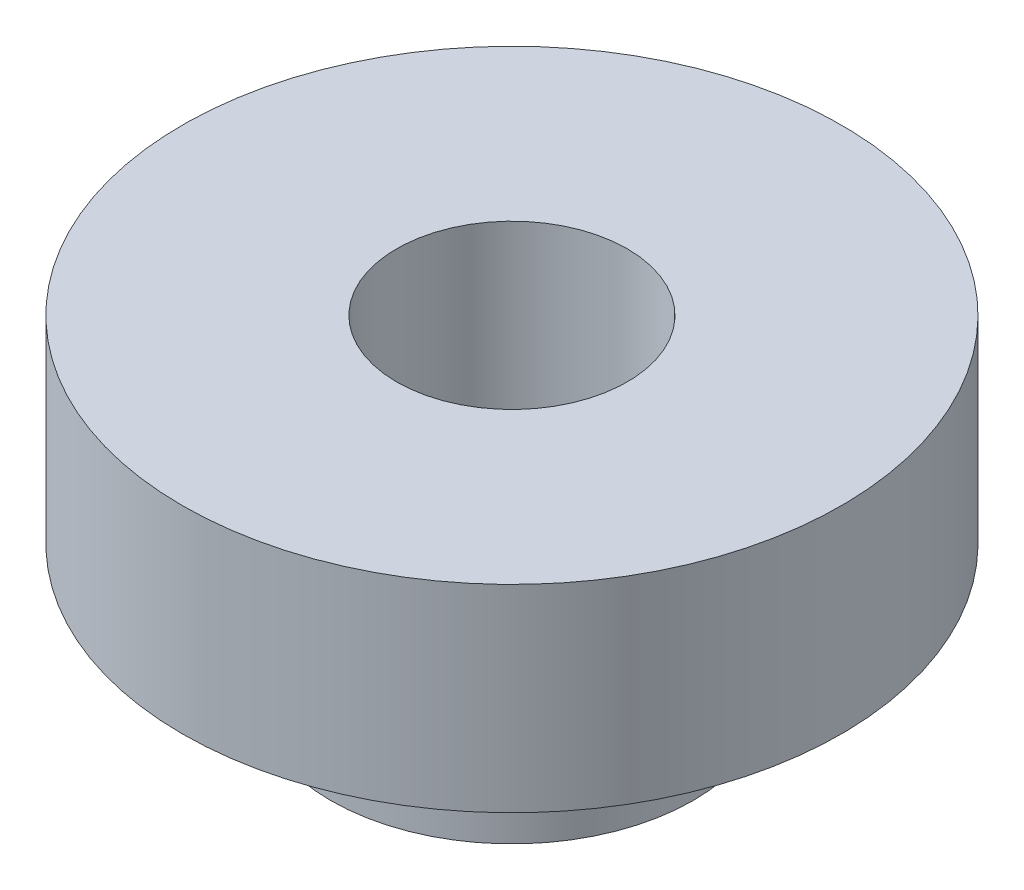
ISO-10303-21;
HEADER;
FILE_DESCRIPTION(('STEP AP214'),'2;1');
FILE_NAME('part.step','',(''),(''),'','','');
FILE_SCHEMA(('AUTOMOTIVE_DESIGN { 1 0 10303 214 1 1 1 1 }'));
ENDSEC;
DATA;
#1=APPLICATION_CONTEXT('core data for automotive mechanical design processes');
#2=APPLICATION_PROTOCOL_DEFINITION('international standard','automotive_design',2000,#1);
#3=PRODUCT_CONTEXT('',#1,'mechanical');
#4=PRODUCT('Part','Part','',(#3));
#5=PRODUCT_RELATED_PRODUCT_CATEGORY('part','',(#4));
#6=PRODUCT_DEFINITION_FORMATION('','',#4);
#7=PRODUCT_DEFINITION_CONTEXT('part definition',#1,'design');
#8=PRODUCT_DEFINITION('design','',#6,#7);
#9=PRODUCT_DEFINITION_SHAPE('','',#8);
#10=(LENGTH_UNIT() NAMED_UNIT(*) SI_UNIT(.MILLI.,.METRE.));
#11=(NAMED_UNIT(*) PLANE_ANGLE_UNIT() SI_UNIT($,.RADIAN.));
#12=(NAMED_UNIT(*) SI_UNIT($,.STERADIAN.) SOLID_ANGLE_UNIT());
#13=UNCERTAINTY_MEASURE_WITH_UNIT(LENGTH_MEASURE(1.E-05),#10,'distance_accuracy_value','');
#14=(GEOMETRIC_REPRESENTATION_CONTEXT(3) GLOBAL_UNCERTAINTY_ASSIGNED_CONTEXT((#13)) GLOBAL_UNIT_ASSIGNED_CONTEXT((#10,
#11,#12)) REPRESENTATION_CONTEXT('',''));
#15=CARTESIAN_POINT('',(0.,0.,0.));
#16=DIRECTION('',(0.,0.,1.));
#17=DIRECTION('',(1.,0.,0.));
#18=AXIS2_PLACEMENT_3D('',#15,#16,#17);
#19=CARTESIAN_POINT('',(-25.4,2.572,-2.66050878019847E-13));
#20=DIRECTION('',(0.,1.,0.));
#21=DIRECTION('',(0.,0.,1.));
#22=AXIS2_PLACEMENT_3D('',#19,#20,#21);
#23=CYLINDRICAL_SURFACE('',#22,2.75);
#24=CARTESIAN_POINT('',(-25.4,2.572,-2.66050878019847E-13));
#25=DIRECTION('',(0.,1.,0.));
#26=DIRECTION('',(0.,0.,1.));
#27=AXIS2_PLACEMENT_3D('',#24,#25,#26);
#28=CIRCLE('',#27,2.75);
#29=CARTESIAN_POINT('',(-25.4,2.572,2.74999999999973));
#30=VERTEX_POINT('',#29);
#31=EDGE_CURVE('E10',#30,#30,#28,.T.);
#32=ORIENTED_EDGE('',*,*,#31,.T.);
#33=EDGE_LOOP('',(#32));
#34=FACE_BOUND('',#33,.T.);
#35=CARTESIAN_POINT('',(-25.4,4.572,-2.66050878019847E-13));
#36=DIRECTION('',(0.,1.,0.));
#37=DIRECTION('',(0.,0.,1.));
#38=AXIS2_PLACEMENT_3D('',#35,#36,#37);
#39=CIRCLE('',#38,2.75);
#40=CARTESIAN_POINT('',(-25.4,4.572,2.74999999999973));
#41=VERTEX_POINT('',#40);
#42=EDGE_CURVE('E41',#41,#41,#39,.T.);
#43=ORIENTED_EDGE('',*,*,#42,.F.);
#44=EDGE_LOOP('',(#43));
#45=FACE_BOUND('',#44,.T.);
#46=ADVANCED_FACE('F38',(#34,#45),#23,.T.);
#47=CARTESIAN_POINT('',(-25.4,2.572,-2.66050878019847E-13));
#48=DIRECTION('',(0.,1.,0.));
#49=DIRECTION('',(0.,0.,1.));
#50=AXIS2_PLACEMENT_3D('',#47,#48,#49);
#51=PLANE('',#50);
#52=CARTESIAN_POINT('',(-25.4,2.572,-2.66050878019847E-13));
#53=DIRECTION('',(0.,1.,0.));
#54=DIRECTION('',(0.,0.,1.));
#55=AXIS2_PLACEMENT_3D('',#52,#53,#54);
#56=CIRCLE('',#55,1.75);
#57=CARTESIAN_POINT('',(-25.4,2.572,1.74999999999973));
#58=VERTEX_POINT('',#57);
#59=EDGE_CURVE('E48',#58,#58,#56,.T.);
#60=ORIENTED_EDGE('',*,*,#59,.T.);
#61=EDGE_LOOP('',(#60));
#62=FACE_BOUND('',#61,.T.);
#63=ORIENTED_EDGE('',*,*,#31,.F.);
#64=EDGE_LOOP('',(#63));
#65=FACE_BOUND('',#64,.T.);
#66=ADVANCED_FACE('F76',(#62,#65),#51,.F.);
#67=CARTESIAN_POINT('',(-25.4,2.572,-2.66050878019847E-13));
#68=DIRECTION('',(0.,1.,0.));
#69=DIRECTION('',(0.,0.,1.));
#70=AXIS2_PLACEMENT_3D('',#67,#68,#69);
#71=CYLINDRICAL_SURFACE('',#70,1.75);
#72=ORIENTED_EDGE('',*,*,#59,.F.);
#73=EDGE_LOOP('',(#72));
#74=FACE_BOUND('',#73,.T.);
#75=CARTESIAN_POINT('',(-25.4,7.572,-2.66050878019847E-13));
#76=DIRECTION('',(0.,1.,0.));
#77=DIRECTION('',(0.,0.,1.));
#78=AXIS2_PLACEMENT_3D('',#75,#76,#77);
#79=CIRCLE('',#78,1.75);
#80=CARTESIAN_POINT('',(-25.4,7.572,1.74999999999973));
#81=VERTEX_POINT('',#80);
#82=EDGE_CURVE('E56',#81,#81,#79,.T.);
#83=ORIENTED_EDGE('',*,*,#82,.T.);
#84=EDGE_LOOP('',(#83));
#85=FACE_BOUND('',#84,.T.);
#86=ADVANCED_FACE('F62',(#74,#85),#71,.F.);
#87=CARTESIAN_POINT('',(-25.4,7.572,-2.66050878019847E-13));
#88=DIRECTION('',(0.,1.,0.));
#89=DIRECTION('',(0.,0.,1.));
#90=AXIS2_PLACEMENT_3D('',#87,#88,#89);
#91=PLANE('',#90);
#92=CARTESIAN_POINT('',(-25.4,7.572,-2.66050878019847E-13));
#93=DIRECTION('',(0.,1.,0.));
#94=DIRECTION('',(0.,0.,1.));
#95=AXIS2_PLACEMENT_3D('',#92,#93,#94);
#96=CIRCLE('',#95,5.);
#97=CARTESIAN_POINT('',(-25.4,7.572,4.99999999999973));
#98=VERTEX_POINT('',#97);
#99=EDGE_CURVE('E52',#98,#98,#96,.T.);
#100=ORIENTED_EDGE('',*,*,#99,.T.);
#101=EDGE_LOOP('',(#100));
#102=FACE_BOUND('',#101,.T.);
#103=ORIENTED_EDGE('',*,*,#82,.F.);
#104=EDGE_LOOP('',(#103));
#105=FACE_BOUND('',#104,.T.);
#106=ADVANCED_FACE('F64',(#102,#105),#91,.T.);
#107=CARTESIAN_POINT('',(-25.4,4.572,-2.66050878019847E-13));
#108=DIRECTION('',(0.,1.,0.));
#109=DIRECTION('',(0.,0.,1.));
#110=AXIS2_PLACEMENT_3D('',#107,#108,#109);
#111=PLANE('',#110);
#112=ORIENTED_EDGE('',*,*,#42,.T.);
#113=EDGE_LOOP('',(#112));
#114=FACE_BOUND('',#113,.T.);
#115=CARTESIAN_POINT('',(-25.4,4.572,-2.66050878019847E-13));
#116=DIRECTION('',(0.,1.,0.));
#117=DIRECTION('',(0.,0.,1.));
#118=AXIS2_PLACEMENT_3D('',#115,#116,#117);
#119=CIRCLE('',#118,5.);
#120=CARTESIAN_POINT('',(-25.4,4.572,4.99999999999973));
#121=VERTEX_POINT('',#120);
#122=EDGE_CURVE('E53',#121,#121,#119,.T.);
#123=ORIENTED_EDGE('',*,*,#122,.F.);
#124=EDGE_LOOP('',(#123));
#125=FACE_BOUND('',#124,.T.);
#126=ADVANCED_FACE('F66',(#114,#125),#111,.F.);
#127=CARTESIAN_POINT('',(-25.4,7.572,-2.66050878019847E-13));
#128=DIRECTION('',(0.,-1.,0.));
#129=DIRECTION('',(0.,0.,-1.));
#130=AXIS2_PLACEMENT_3D('',#127,#128,#129);
#131=CYLINDRICAL_SURFACE('',#130,5.);
#132=ORIENTED_EDGE('',*,*,#99,.F.);
#133=EDGE_LOOP('',(#132));
#134=FACE_BOUND('',#133,.T.);
#135=ORIENTED_EDGE('',*,*,#122,.T.);
#136=EDGE_LOOP('',(#135));
#137=FACE_BOUND('',#136,.T.);
#138=ADVANCED_FACE('F73',(#134,#137),#131,.T.);
#139=CLOSED_SHELL('',(#46,#66,#86,#106,#126,#138));
#140=MANIFOLD_SOLID_BREP('B2',#139);
#141=ADVANCED_BREP_SHAPE_REPRESENTATION('',(#18,#140),#14);
#142=SHAPE_DEFINITION_REPRESENTATION(#9,#141);
ENDSEC;
END-ISO-10303-21;
